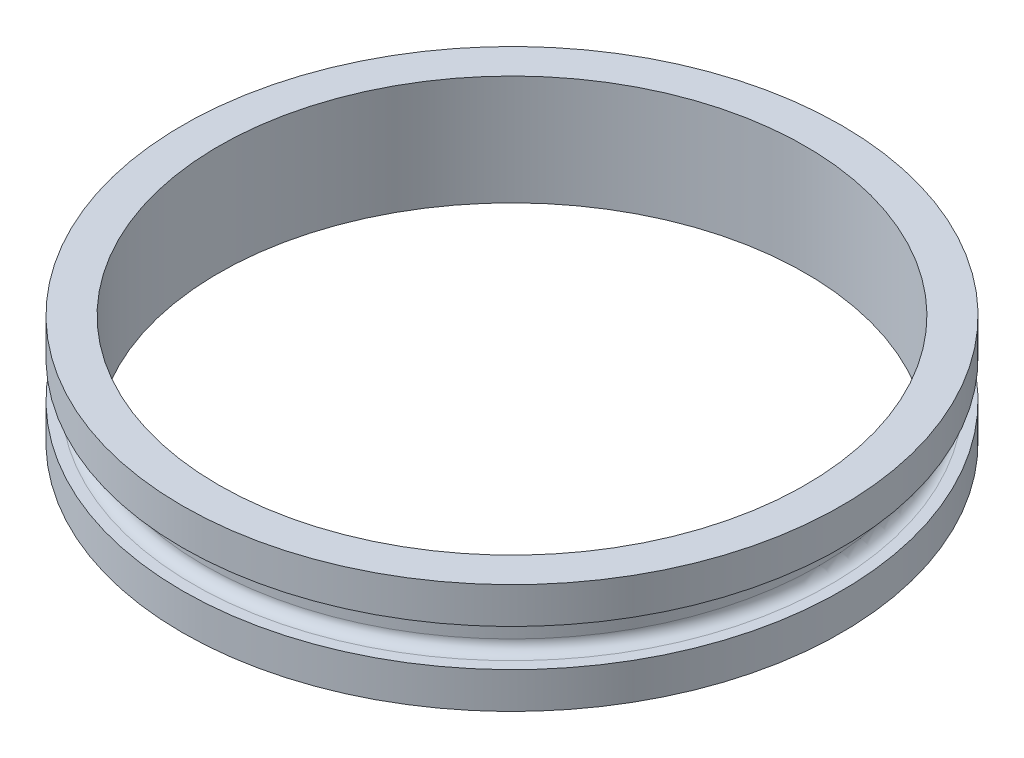
ISO-10303-21;
HEADER;
FILE_DESCRIPTION(('STEP AP214'),'2;1');
FILE_NAME('part.step','',(''),(''),'','','');
FILE_SCHEMA(('AUTOMOTIVE_DESIGN { 1 0 10303 214 1 1 1 1 }'));
ENDSEC;
DATA;
#1=APPLICATION_CONTEXT('core data for automotive mechanical design processes');
#2=APPLICATION_PROTOCOL_DEFINITION('international standard','automotive_design',2000,#1);
#3=PRODUCT_CONTEXT('',#1,'mechanical');
#4=PRODUCT('Part','Part','',(#3));
#5=PRODUCT_RELATED_PRODUCT_CATEGORY('part','',(#4));
#6=PRODUCT_DEFINITION_FORMATION('','',#4);
#7=PRODUCT_DEFINITION_CONTEXT('part definition',#1,'design');
#8=PRODUCT_DEFINITION('design','',#6,#7);
#9=PRODUCT_DEFINITION_SHAPE('','',#8);
#10=(LENGTH_UNIT() NAMED_UNIT(*) SI_UNIT(.MILLI.,.METRE.));
#11=(NAMED_UNIT(*) PLANE_ANGLE_UNIT() SI_UNIT($,.RADIAN.));
#12=(NAMED_UNIT(*) SI_UNIT($,.STERADIAN.) SOLID_ANGLE_UNIT());
#13=UNCERTAINTY_MEASURE_WITH_UNIT(LENGTH_MEASURE(1.E-05),#10,'distance_accuracy_value','');
#14=(GEOMETRIC_REPRESENTATION_CONTEXT(3) GLOBAL_UNCERTAINTY_ASSIGNED_CONTEXT((#13)) GLOBAL_UNIT_ASSIGNED_CONTEXT((#10,
#11,#12)) REPRESENTATION_CONTEXT('',''));
#15=CARTESIAN_POINT('',(0.,0.,0.));
#16=DIRECTION('',(0.,0.,1.));
#17=DIRECTION('',(1.,0.,0.));
#18=AXIS2_PLACEMENT_3D('',#15,#16,#17);
#19=CARTESIAN_POINT('',(38.1,0.,0.));
#20=DIRECTION('',(0.,1.,0.));
#21=DIRECTION('',(0.,0.,1.));
#22=AXIS2_PLACEMENT_3D('',#19,#20,#21);
#23=PLANE('',#22);
#24=CARTESIAN_POINT('',(0.,0.,0.));
#25=DIRECTION('',(0.,1.,0.));
#26=DIRECTION('',(0.,0.,1.));
#27=AXIS2_PLACEMENT_3D('',#24,#25,#26);
#28=CIRCLE('',#27,38.1);
#29=CARTESIAN_POINT('',(0.,0.,38.1));
#30=VERTEX_POINT('',#29);
#31=EDGE_CURVE('E68',#30,#30,#28,.T.);
#32=ORIENTED_EDGE('',*,*,#31,.F.);
#33=EDGE_LOOP('',(#32));
#34=FACE_BOUND('',#33,.T.);
#35=CARTESIAN_POINT('',(0.,0.,0.));
#36=DIRECTION('',(0.,1.,0.));
#37=DIRECTION('',(0.,0.,1.));
#38=AXIS2_PLACEMENT_3D('',#35,#36,#37);
#39=CIRCLE('',#38,33.9217);
#40=CARTESIAN_POINT('',(0.,0.,33.9217));
#41=VERTEX_POINT('',#40);
#42=EDGE_CURVE('E53',#41,#41,#39,.T.);
#43=ORIENTED_EDGE('',*,*,#42,.T.);
#44=EDGE_LOOP('',(#43));
#45=FACE_BOUND('',#44,.T.);
#46=ADVANCED_FACE('F33',(#34,#45),#23,.F.);
#47=CARTESIAN_POINT('',(0.,13.335,0.));
#48=DIRECTION('',(0.,1.,0.));
#49=DIRECTION('',(0.,0.,1.));
#50=AXIS2_PLACEMENT_3D('',#47,#48,#49);
#51=CYLINDRICAL_SURFACE('',#50,33.9217);
#52=ORIENTED_EDGE('',*,*,#42,.F.);
#53=EDGE_LOOP('',(#52));
#54=FACE_BOUND('',#53,.T.);
#55=CARTESIAN_POINT('',(0.,12.7,0.));
#56=DIRECTION('',(0.,1.,0.));
#57=DIRECTION('',(0.,0.,1.));
#58=AXIS2_PLACEMENT_3D('',#55,#56,#57);
#59=CIRCLE('',#58,33.9217);
#60=CARTESIAN_POINT('',(0.,12.7,33.9217));
#61=VERTEX_POINT('',#60);
#62=EDGE_CURVE('E56',#61,#61,#59,.T.);
#63=ORIENTED_EDGE('',*,*,#62,.T.);
#64=EDGE_LOOP('',(#63));
#65=FACE_BOUND('',#64,.T.);
#66=ADVANCED_FACE('F76',(#54,#65),#51,.F.);
#67=CARTESIAN_POINT('',(33.9217,12.7,0.));
#68=DIRECTION('',(0.,-1.,0.));
#69=DIRECTION('',(0.,0.,-1.));
#70=AXIS2_PLACEMENT_3D('',#67,#68,#69);
#71=PLANE('',#70);
#72=ORIENTED_EDGE('',*,*,#62,.F.);
#73=EDGE_LOOP('',(#72));
#74=FACE_BOUND('',#73,.T.);
#75=CARTESIAN_POINT('',(0.,12.7,0.));
#76=DIRECTION('',(0.,1.,0.));
#77=DIRECTION('',(0.,0.,1.));
#78=AXIS2_PLACEMENT_3D('',#75,#76,#77);
#79=CIRCLE('',#78,38.1);
#80=CARTESIAN_POINT('',(0.,12.7,38.1));
#81=VERTEX_POINT('',#80);
#82=EDGE_CURVE('E59',#81,#81,#79,.T.);
#83=ORIENTED_EDGE('',*,*,#82,.T.);
#84=EDGE_LOOP('',(#83));
#85=FACE_BOUND('',#84,.T.);
#86=ADVANCED_FACE('F82',(#74,#85),#71,.F.);
#87=CARTESIAN_POINT('',(0.,13.335,0.));
#88=DIRECTION('',(0.,1.,0.));
#89=DIRECTION('',(0.,0.,1.));
#90=AXIS2_PLACEMENT_3D('',#87,#88,#89);
#91=CYLINDRICAL_SURFACE('',#90,38.1);
#92=ORIENTED_EDGE('',*,*,#82,.F.);
#93=EDGE_LOOP('',(#92));
#94=FACE_BOUND('',#93,.T.);
#95=CARTESIAN_POINT('',(0.,8.509,0.));
#96=DIRECTION('',(0.,1.,0.));
#97=DIRECTION('',(0.,0.,1.));
#98=AXIS2_PLACEMENT_3D('',#95,#96,#97);
#99=CIRCLE('',#98,38.1);
#100=CARTESIAN_POINT('',(0.,8.509,38.1));
#101=VERTEX_POINT('',#100);
#102=EDGE_CURVE('E62',#101,#101,#99,.T.);
#103=ORIENTED_EDGE('',*,*,#102,.T.);
#104=EDGE_LOOP('',(#103));
#105=FACE_BOUND('',#104,.T.);
#106=ADVANCED_FACE('F88',(#94,#105),#91,.T.);
#107=CARTESIAN_POINT('',(38.1,8.509,0.));
#108=DIRECTION('',(0.,1.,0.));
#109=DIRECTION('',(0.,0.,1.));
#110=AXIS2_PLACEMENT_3D('',#107,#108,#109);
#111=PLANE('',#110);
#112=CARTESIAN_POINT('',(0.,8.509,0.));
#113=DIRECTION('',(0.,1.,0.));
#114=DIRECTION('',(0.,0.,1.));
#115=AXIS2_PLACEMENT_3D('',#112,#113,#114);
#116=CIRCLE('',#115,36.83);
#117=CARTESIAN_POINT('',(0.,8.509,36.83));
#118=VERTEX_POINT('',#117);
#119=EDGE_CURVE('E10',#118,#118,#116,.T.);
#120=ORIENTED_EDGE('',*,*,#119,.T.);
#121=EDGE_LOOP('',(#120));
#122=FACE_BOUND('',#121,.T.);
#123=ORIENTED_EDGE('',*,*,#102,.F.);
#124=EDGE_LOOP('',(#123));
#125=FACE_BOUND('',#124,.T.);
#126=ADVANCED_FACE('F94',(#122,#125),#111,.F.);
#127=CARTESIAN_POINT('',(0.,13.335,0.));
#128=DIRECTION('',(0.,1.,0.));
#129=DIRECTION('',(0.,0.,1.));
#130=AXIS2_PLACEMENT_3D('',#127,#128,#129);
#131=CYLINDRICAL_SURFACE('',#130,35.56);
#132=CARTESIAN_POINT('',(0.,5.461,0.));
#133=DIRECTION('',(0.,-1.,0.));
#134=DIRECTION('',(0.,0.,-1.));
#135=AXIS2_PLACEMENT_3D('',#132,#133,#134);
#136=CIRCLE('',#135,35.56);
#137=CARTESIAN_POINT('',(0.,5.461,-35.56));
#138=VERTEX_POINT('',#137);
#139=EDGE_CURVE('E44',#138,#138,#136,.F.);
#140=ORIENTED_EDGE('',*,*,#139,.T.);
#141=EDGE_LOOP('',(#140));
#142=FACE_BOUND('',#141,.T.);
#143=CARTESIAN_POINT('',(0.,7.239,0.));
#144=DIRECTION('',(0.,1.,0.));
#145=DIRECTION('',(0.,0.,1.));
#146=AXIS2_PLACEMENT_3D('',#143,#144,#145);
#147=CIRCLE('',#146,35.56);
#148=CARTESIAN_POINT('',(0.,7.239,35.56));
#149=VERTEX_POINT('',#148);
#150=EDGE_CURVE('E48',#149,#149,#147,.F.);
#151=ORIENTED_EDGE('',*,*,#150,.T.);
#152=EDGE_LOOP('',(#151));
#153=FACE_BOUND('',#152,.T.);
#154=ADVANCED_FACE('F99',(#142,#153),#131,.T.);
#155=CARTESIAN_POINT('',(35.56,4.191,0.));
#156=DIRECTION('',(0.,-1.,0.));
#157=DIRECTION('',(0.,0.,-1.));
#158=AXIS2_PLACEMENT_3D('',#155,#156,#157);
#159=PLANE('',#158);
#160=CARTESIAN_POINT('',(0.,4.191,0.));
#161=DIRECTION('',(0.,-1.,0.));
#162=DIRECTION('',(0.,0.,-1.));
#163=AXIS2_PLACEMENT_3D('',#160,#161,#162);
#164=CIRCLE('',#163,36.83);
#165=CARTESIAN_POINT('',(0.,4.191,-36.83));
#166=VERTEX_POINT('',#165);
#167=EDGE_CURVE('E40',#166,#166,#164,.T.);
#168=ORIENTED_EDGE('',*,*,#167,.T.);
#169=EDGE_LOOP('',(#168));
#170=FACE_BOUND('',#169,.T.);
#171=CARTESIAN_POINT('',(0.,4.191,0.));
#172=DIRECTION('',(0.,1.,0.));
#173=DIRECTION('',(0.,0.,1.));
#174=AXIS2_PLACEMENT_3D('',#171,#172,#173);
#175=CIRCLE('',#174,38.1);
#176=CARTESIAN_POINT('',(0.,4.191,38.1));
#177=VERTEX_POINT('',#176);
#178=EDGE_CURVE('E65',#177,#177,#175,.T.);
#179=ORIENTED_EDGE('',*,*,#178,.T.);
#180=EDGE_LOOP('',(#179));
#181=FACE_BOUND('',#180,.T.);
#182=ADVANCED_FACE('F104',(#170,#181),#159,.F.);
#183=CARTESIAN_POINT('',(0.,13.335,0.));
#184=DIRECTION('',(0.,1.,0.));
#185=DIRECTION('',(0.,0.,1.));
#186=AXIS2_PLACEMENT_3D('',#183,#184,#185);
#187=CYLINDRICAL_SURFACE('',#186,38.1);
#188=ORIENTED_EDGE('',*,*,#178,.F.);
#189=EDGE_LOOP('',(#188));
#190=FACE_BOUND('',#189,.T.);
#191=ORIENTED_EDGE('',*,*,#31,.T.);
#192=EDGE_LOOP('',(#191));
#193=FACE_BOUND('',#192,.T.);
#194=ADVANCED_FACE('F72',(#190,#193),#187,.T.);
#195=CARTESIAN_POINT('',(0.,5.461,0.));
#196=DIRECTION('',(0.,-1.,0.));
#197=DIRECTION('',(0.,0.,-1.));
#198=AXIS2_PLACEMENT_3D('',#195,#196,#197);
#199=TOROIDAL_SURFACE('',#198,36.83,1.27);
#200=ORIENTED_EDGE('',*,*,#167,.F.);
#201=EDGE_LOOP('',(#200));
#202=FACE_BOUND('',#201,.T.);
#203=ORIENTED_EDGE('',*,*,#139,.F.);
#204=EDGE_LOOP('',(#203));
#205=FACE_BOUND('',#204,.T.);
#206=ADVANCED_FACE('F108',(#202,#205),#199,.F.);
#207=CARTESIAN_POINT('',(0.,7.239,0.));
#208=DIRECTION('',(0.,1.,0.));
#209=DIRECTION('',(0.,0.,1.));
#210=AXIS2_PLACEMENT_3D('',#207,#208,#209);
#211=TOROIDAL_SURFACE('',#210,36.83,1.27);
#212=ORIENTED_EDGE('',*,*,#150,.F.);
#213=EDGE_LOOP('',(#212));
#214=FACE_BOUND('',#213,.T.);
#215=ORIENTED_EDGE('',*,*,#119,.F.);
#216=EDGE_LOOP('',(#215));
#217=FACE_BOUND('',#216,.T.);
#218=ADVANCED_FACE('F35',(#214,#217),#211,.F.);
#219=CLOSED_SHELL('',(#46,#66,#86,#106,#126,#154,#182,#194,#206,#218));
#220=MANIFOLD_SOLID_BREP('B2',#219);
#221=ADVANCED_BREP_SHAPE_REPRESENTATION('',(#18,#220),#14);
#222=SHAPE_DEFINITION_REPRESENTATION(#9,#221);
ENDSEC;
END-ISO-10303-21;
